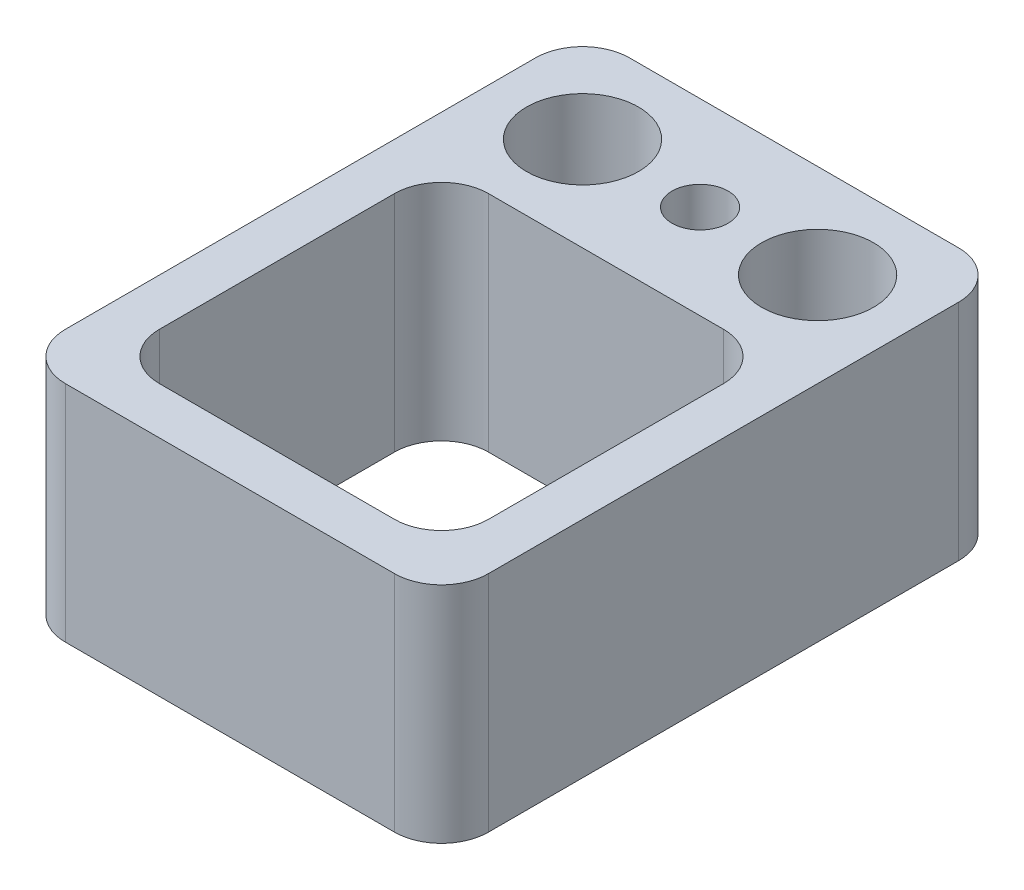
ISO-10303-21;
HEADER;
FILE_DESCRIPTION(('STEP AP214'),'2;1');
FILE_NAME('part.step','',(''),(''),'','','');
FILE_SCHEMA(('AUTOMOTIVE_DESIGN { 1 0 10303 214 1 1 1 1 }'));
ENDSEC;
DATA;
#1=APPLICATION_CONTEXT('core data for automotive mechanical design processes');
#2=APPLICATION_PROTOCOL_DEFINITION('international standard','automotive_design',2000,#1);
#3=PRODUCT_CONTEXT('',#1,'mechanical');
#4=PRODUCT('Part','Part','',(#3));
#5=PRODUCT_RELATED_PRODUCT_CATEGORY('part','',(#4));
#6=PRODUCT_DEFINITION_FORMATION('','',#4);
#7=PRODUCT_DEFINITION_CONTEXT('part definition',#1,'design');
#8=PRODUCT_DEFINITION('design','',#6,#7);
#9=PRODUCT_DEFINITION_SHAPE('','',#8);
#10=(LENGTH_UNIT() NAMED_UNIT(*) SI_UNIT(.MILLI.,.METRE.));
#11=(NAMED_UNIT(*) PLANE_ANGLE_UNIT() SI_UNIT($,.RADIAN.));
#12=(NAMED_UNIT(*) SI_UNIT($,.STERADIAN.) SOLID_ANGLE_UNIT());
#13=UNCERTAINTY_MEASURE_WITH_UNIT(LENGTH_MEASURE(1.E-05),#10,'distance_accuracy_value','');
#14=(GEOMETRIC_REPRESENTATION_CONTEXT(3) GLOBAL_UNCERTAINTY_ASSIGNED_CONTEXT((#13)) GLOBAL_UNIT_ASSIGNED_CONTEXT((#10,
#11,#12)) REPRESENTATION_CONTEXT('',''));
#15=CARTESIAN_POINT('',(0.,0.,0.));
#16=DIRECTION('',(0.,0.,1.));
#17=DIRECTION('',(1.,0.,0.));
#18=AXIS2_PLACEMENT_3D('',#15,#16,#17);
#19=CARTESIAN_POINT('',(-4.5,4.7625,6.));
#20=DIRECTION('',(1.,0.,0.));
#21=DIRECTION('',(0.,0.,-1.));
#22=AXIS2_PLACEMENT_3D('',#19,#20,#21);
#23=PLANE('',#22);
#24=DIRECTION('',(0.,0.,1.));
#25=VECTOR('',#24,1.);
#26=CARTESIAN_POINT('',(-4.5,0.,6.));
#27=LINE('',#26,#25);
#28=CARTESIAN_POINT('',(-4.5,0.,-5.));
#29=VERTEX_POINT('',#28);
#30=CARTESIAN_POINT('',(-4.5,0.,5.));
#31=VERTEX_POINT('',#30);
#32=EDGE_CURVE('E196',#29,#31,#27,.T.);
#33=ORIENTED_EDGE('',*,*,#32,.T.);
#34=DIRECTION('',(0.,-1.,0.));
#35=VECTOR('',#34,1.);
#36=CARTESIAN_POINT('',(-4.5,4.7625,5.));
#37=LINE('',#36,#35);
#38=CARTESIAN_POINT('',(-4.5,4.7625,5.));
#39=VERTEX_POINT('',#38);
#40=EDGE_CURVE('E246',#31,#39,#37,.F.);
#41=ORIENTED_EDGE('',*,*,#40,.T.);
#42=DIRECTION('',(0.,0.,1.));
#43=VECTOR('',#42,1.);
#44=CARTESIAN_POINT('',(-4.5,4.7625,6.));
#45=LINE('',#44,#43);
#46=CARTESIAN_POINT('',(-4.5,4.7625,-5.));
#47=VERTEX_POINT('',#46);
#48=EDGE_CURVE('E185',#47,#39,#45,.T.);
#49=ORIENTED_EDGE('',*,*,#48,.F.);
#50=DIRECTION('',(0.,-1.,0.));
#51=VECTOR('',#50,1.);
#52=CARTESIAN_POINT('',(-4.5,4.7625,-5.));
#53=LINE('',#52,#51);
#54=EDGE_CURVE('E243',#47,#29,#53,.T.);
#55=ORIENTED_EDGE('',*,*,#54,.T.);
#56=EDGE_LOOP('',(#33,#41,#49,#55));
#57=FACE_BOUND('',#56,.T.);
#58=ADVANCED_FACE('F31',(#57),#23,.F.);
#59=CARTESIAN_POINT('',(4.5,4.7625,6.));
#60=DIRECTION('',(0.,0.,-1.));
#61=DIRECTION('',(-1.,0.,0.));
#62=AXIS2_PLACEMENT_3D('',#59,#60,#61);
#63=PLANE('',#62);
#64=DIRECTION('',(1.,0.,0.));
#65=VECTOR('',#64,1.);
#66=CARTESIAN_POINT('',(4.5,4.7625,6.));
#67=LINE('',#66,#65);
#68=CARTESIAN_POINT('',(-3.5,4.7625,6.));
#69=VERTEX_POINT('',#68);
#70=CARTESIAN_POINT('',(3.5,4.7625,6.));
#71=VERTEX_POINT('',#70);
#72=EDGE_CURVE('E188',#69,#71,#67,.T.);
#73=ORIENTED_EDGE('',*,*,#72,.F.);
#74=DIRECTION('',(0.,-1.,0.));
#75=VECTOR('',#74,1.);
#76=CARTESIAN_POINT('',(-3.5,4.7625,6.));
#77=LINE('',#76,#75);
#78=CARTESIAN_POINT('',(-3.5,0.,6.));
#79=VERTEX_POINT('',#78);
#80=EDGE_CURVE('E232',#69,#79,#77,.T.);
#81=ORIENTED_EDGE('',*,*,#80,.T.);
#82=DIRECTION('',(1.,0.,0.));
#83=VECTOR('',#82,1.);
#84=CARTESIAN_POINT('',(4.5,0.,6.));
#85=LINE('',#84,#83);
#86=CARTESIAN_POINT('',(3.5,0.,6.));
#87=VERTEX_POINT('',#86);
#88=EDGE_CURVE('E199',#79,#87,#85,.T.);
#89=ORIENTED_EDGE('',*,*,#88,.T.);
#90=DIRECTION('',(0.,-1.,0.));
#91=VECTOR('',#90,1.);
#92=CARTESIAN_POINT('',(3.5,4.7625,6.));
#93=LINE('',#92,#91);
#94=EDGE_CURVE('E230',#87,#71,#93,.F.);
#95=ORIENTED_EDGE('',*,*,#94,.T.);
#96=EDGE_LOOP('',(#73,#81,#89,#95));
#97=FACE_BOUND('',#96,.T.);
#98=ADVANCED_FACE('F316',(#97),#63,.F.);
#99=CARTESIAN_POINT('',(4.5,4.7625,6.));
#100=DIRECTION('',(-1.,0.,0.));
#101=DIRECTION('',(0.,0.,1.));
#102=AXIS2_PLACEMENT_3D('',#99,#100,#101);
#103=PLANE('',#102);
#104=DIRECTION('',(0.,0.,-1.));
#105=VECTOR('',#104,1.);
#106=CARTESIAN_POINT('',(4.5,4.7625,6.));
#107=LINE('',#106,#105);
#108=CARTESIAN_POINT('',(4.5,4.7625,5.));
#109=VERTEX_POINT('',#108);
#110=CARTESIAN_POINT('',(4.5,4.7625,-5.));
#111=VERTEX_POINT('',#110);
#112=EDGE_CURVE('E192',#109,#111,#107,.T.);
#113=ORIENTED_EDGE('',*,*,#112,.F.);
#114=DIRECTION('',(0.,-1.,0.));
#115=VECTOR('',#114,1.);
#116=CARTESIAN_POINT('',(4.5,4.7625,5.));
#117=LINE('',#116,#115);
#118=CARTESIAN_POINT('',(4.5,0.,5.));
#119=VERTEX_POINT('',#118);
#120=EDGE_CURVE('E257',#109,#119,#117,.T.);
#121=ORIENTED_EDGE('',*,*,#120,.T.);
#122=DIRECTION('',(0.,0.,-1.));
#123=VECTOR('',#122,1.);
#124=CARTESIAN_POINT('',(4.5,0.,6.));
#125=LINE('',#124,#123);
#126=CARTESIAN_POINT('',(4.5,0.,-5.));
#127=VERTEX_POINT('',#126);
#128=EDGE_CURVE('E203',#119,#127,#125,.T.);
#129=ORIENTED_EDGE('',*,*,#128,.T.);
#130=DIRECTION('',(0.,-1.,0.));
#131=VECTOR('',#130,1.);
#132=CARTESIAN_POINT('',(4.5,4.7625,-5.));
#133=LINE('',#132,#131);
#134=EDGE_CURVE('E255',#127,#111,#133,.F.);
#135=ORIENTED_EDGE('',*,*,#134,.T.);
#136=EDGE_LOOP('',(#113,#121,#129,#135));
#137=FACE_BOUND('',#136,.T.);
#138=ADVANCED_FACE('F322',(#137),#103,.F.);
#139=CARTESIAN_POINT('',(4.5,4.7625,-6.));
#140=DIRECTION('',(0.,0.,1.));
#141=DIRECTION('',(1.,0.,0.));
#142=AXIS2_PLACEMENT_3D('',#139,#140,#141);
#143=PLANE('',#142);
#144=DIRECTION('',(-1.,0.,0.));
#145=VECTOR('',#144,1.);
#146=CARTESIAN_POINT('',(4.5,4.7625,-6.));
#147=LINE('',#146,#145);
#148=CARTESIAN_POINT('',(3.5,4.7625,-6.));
#149=VERTEX_POINT('',#148);
#150=CARTESIAN_POINT('',(-3.5,4.7625,-6.));
#151=VERTEX_POINT('',#150);
#152=EDGE_CURVE('E194',#149,#151,#147,.T.);
#153=ORIENTED_EDGE('',*,*,#152,.F.);
#154=DIRECTION('',(0.,-1.,0.));
#155=VECTOR('',#154,1.);
#156=CARTESIAN_POINT('',(3.5,4.7625,-6.));
#157=LINE('',#156,#155);
#158=CARTESIAN_POINT('',(3.5,0.,-6.));
#159=VERTEX_POINT('',#158);
#160=EDGE_CURVE('E156',#149,#159,#157,.T.);
#161=ORIENTED_EDGE('',*,*,#160,.T.);
#162=DIRECTION('',(-1.,0.,0.));
#163=VECTOR('',#162,1.);
#164=CARTESIAN_POINT('',(4.5,0.,-6.));
#165=LINE('',#164,#163);
#166=CARTESIAN_POINT('',(-3.5,0.,-6.));
#167=VERTEX_POINT('',#166);
#168=EDGE_CURVE('E189',#159,#167,#165,.T.);
#169=ORIENTED_EDGE('',*,*,#168,.T.);
#170=DIRECTION('',(0.,-1.,0.));
#171=VECTOR('',#170,1.);
#172=CARTESIAN_POINT('',(-3.5,4.7625,-6.));
#173=LINE('',#172,#171);
#174=EDGE_CURVE('E46',#167,#151,#173,.F.);
#175=ORIENTED_EDGE('',*,*,#174,.T.);
#176=EDGE_LOOP('',(#153,#161,#169,#175));
#177=FACE_BOUND('',#176,.T.);
#178=ADVANCED_FACE('F328',(#177),#143,.F.);
#179=CARTESIAN_POINT('',(-4.5,4.7625,-6.));
#180=DIRECTION('',(0.,1.,0.));
#181=DIRECTION('',(0.,0.,1.));
#182=AXIS2_PLACEMENT_3D('',#179,#180,#181);
#183=PLANE('',#182);
#184=CARTESIAN_POINT('',(-2.5,4.7625,-4.));
#185=DIRECTION('',(0.,1.,0.));
#186=DIRECTION('',(0.,0.,1.));
#187=AXIS2_PLACEMENT_3D('',#184,#185,#186);
#188=CIRCLE('',#187,1.190625);
#189=CARTESIAN_POINT('',(-2.5,4.7625,-2.809375));
#190=VERTEX_POINT('',#189);
#191=EDGE_CURVE('E215',#190,#190,#188,.T.);
#192=ORIENTED_EDGE('',*,*,#191,.F.);
#193=EDGE_LOOP('',(#192));
#194=FACE_BOUND('',#193,.T.);
#195=CARTESIAN_POINT('',(2.5,4.7625,-4.));
#196=DIRECTION('',(0.,1.,0.));
#197=DIRECTION('',(0.,0.,1.));
#198=AXIS2_PLACEMENT_3D('',#195,#196,#197);
#199=CIRCLE('',#198,1.190625);
#200=CARTESIAN_POINT('',(2.5,4.7625,-2.809375));
#201=VERTEX_POINT('',#200);
#202=EDGE_CURVE('E211',#201,#201,#199,.T.);
#203=ORIENTED_EDGE('',*,*,#202,.F.);
#204=EDGE_LOOP('',(#203));
#205=FACE_BOUND('',#204,.T.);
#206=CARTESIAN_POINT('',(0.,4.7625,-4.));
#207=DIRECTION('',(0.,1.,0.));
#208=DIRECTION('',(0.,0.,1.));
#209=AXIS2_PLACEMENT_3D('',#206,#207,#208);
#210=CIRCLE('',#209,0.595629999999988);
#211=CARTESIAN_POINT('',(0.,4.7625,-3.40437000000001));
#212=VERTEX_POINT('',#211);
#213=EDGE_CURVE('E210',#212,#212,#210,.T.);
#214=ORIENTED_EDGE('',*,*,#213,.F.);
#215=EDGE_LOOP('',(#214));
#216=FACE_BOUND('',#215,.T.);
#217=DIRECTION('',(0.,0.,1.));
#218=VECTOR('',#217,1.);
#219=CARTESIAN_POINT('',(-3.5,4.7625,5.));
#220=LINE('',#219,#218);
#221=CARTESIAN_POINT('',(-3.5,4.7625,-1.));
#222=VERTEX_POINT('',#221);
#223=CARTESIAN_POINT('',(-3.5,4.7625,4.));
#224=VERTEX_POINT('',#223);
#225=EDGE_CURVE('E173',#222,#224,#220,.T.);
#226=ORIENTED_EDGE('',*,*,#225,.F.);
#227=CARTESIAN_POINT('',(-2.5,4.7625,-1.));
#228=DIRECTION('',(0.,1.,0.));
#229=DIRECTION('',(0.,0.,1.));
#230=AXIS2_PLACEMENT_3D('',#227,#228,#229);
#231=CIRCLE('',#230,1.);
#232=CARTESIAN_POINT('',(-2.5,4.7625,-2.));
#233=VERTEX_POINT('',#232);
#234=EDGE_CURVE('E39',#222,#233,#231,.F.);
#235=ORIENTED_EDGE('',*,*,#234,.T.);
#236=DIRECTION('',(-1.,0.,0.));
#237=VECTOR('',#236,1.);
#238=CARTESIAN_POINT('',(-3.5,4.7625,-2.));
#239=LINE('',#238,#237);
#240=CARTESIAN_POINT('',(2.5,4.7625,-2.));
#241=VERTEX_POINT('',#240);
#242=EDGE_CURVE('E176',#241,#233,#239,.T.);
#243=ORIENTED_EDGE('',*,*,#242,.F.);
#244=CARTESIAN_POINT('',(2.5,4.7625,-1.));
#245=DIRECTION('',(0.,1.,0.));
#246=DIRECTION('',(0.,0.,1.));
#247=AXIS2_PLACEMENT_3D('',#244,#245,#246);
#248=CIRCLE('',#247,1.);
#249=CARTESIAN_POINT('',(3.5,4.7625,-1.));
#250=VERTEX_POINT('',#249);
#251=EDGE_CURVE('E267',#241,#250,#248,.F.);
#252=ORIENTED_EDGE('',*,*,#251,.T.);
#253=DIRECTION('',(0.,0.,-1.));
#254=VECTOR('',#253,1.);
#255=CARTESIAN_POINT('',(3.5,4.7625,5.));
#256=LINE('',#255,#254);
#257=CARTESIAN_POINT('',(3.5,4.7625,4.));
#258=VERTEX_POINT('',#257);
#259=EDGE_CURVE('E172',#258,#250,#256,.T.);
#260=ORIENTED_EDGE('',*,*,#259,.F.);
#261=CARTESIAN_POINT('',(2.5,4.7625,4.));
#262=DIRECTION('',(0.,1.,0.));
#263=DIRECTION('',(0.,0.,1.));
#264=AXIS2_PLACEMENT_3D('',#261,#262,#263);
#265=CIRCLE('',#264,1.);
#266=CARTESIAN_POINT('',(2.5,4.7625,5.));
#267=VERTEX_POINT('',#266);
#268=EDGE_CURVE('E171',#258,#267,#265,.F.);
#269=ORIENTED_EDGE('',*,*,#268,.T.);
#270=DIRECTION('',(1.,0.,0.));
#271=VECTOR('',#270,1.);
#272=CARTESIAN_POINT('',(-3.5,4.7625,5.));
#273=LINE('',#272,#271);
#274=CARTESIAN_POINT('',(-2.5,4.7625,5.));
#275=VERTEX_POINT('',#274);
#276=EDGE_CURVE('E162',#275,#267,#273,.T.);
#277=ORIENTED_EDGE('',*,*,#276,.F.);
#278=CARTESIAN_POINT('',(-2.5,4.7625,4.));
#279=DIRECTION('',(0.,1.,0.));
#280=DIRECTION('',(0.,0.,1.));
#281=AXIS2_PLACEMENT_3D('',#278,#279,#280);
#282=CIRCLE('',#281,1.);
#283=EDGE_CURVE('E145',#275,#224,#282,.F.);
#284=ORIENTED_EDGE('',*,*,#283,.T.);
#285=EDGE_LOOP('',(#226,#235,#243,#252,#260,#269,#277,#284));
#286=FACE_BOUND('',#285,.T.);
#287=ORIENTED_EDGE('',*,*,#48,.T.);
#288=CARTESIAN_POINT('',(-3.5,4.7625,5.));
#289=DIRECTION('',(0.,1.,0.));
#290=DIRECTION('',(0.,0.,1.));
#291=AXIS2_PLACEMENT_3D('',#288,#289,#290);
#292=CIRCLE('',#291,1.);
#293=EDGE_CURVE('E253',#39,#69,#292,.T.);
#294=ORIENTED_EDGE('',*,*,#293,.T.);
#295=ORIENTED_EDGE('',*,*,#72,.T.);
#296=CARTESIAN_POINT('',(3.5,4.7625,5.));
#297=DIRECTION('',(0.,1.,0.));
#298=DIRECTION('',(0.,0.,1.));
#299=AXIS2_PLACEMENT_3D('',#296,#297,#298);
#300=CIRCLE('',#299,1.);
#301=EDGE_CURVE('E251',#71,#109,#300,.T.);
#302=ORIENTED_EDGE('',*,*,#301,.T.);
#303=ORIENTED_EDGE('',*,*,#112,.T.);
#304=CARTESIAN_POINT('',(3.5,4.7625,-5.));
#305=DIRECTION('',(0.,1.,0.));
#306=DIRECTION('',(0.,0.,1.));
#307=AXIS2_PLACEMENT_3D('',#304,#305,#306);
#308=CIRCLE('',#307,1.);
#309=EDGE_CURVE('E53',#111,#149,#308,.T.);
#310=ORIENTED_EDGE('',*,*,#309,.T.);
#311=ORIENTED_EDGE('',*,*,#152,.T.);
#312=CARTESIAN_POINT('',(-3.5,4.7625,-5.));
#313=DIRECTION('',(0.,1.,0.));
#314=DIRECTION('',(0.,0.,1.));
#315=AXIS2_PLACEMENT_3D('',#312,#313,#314);
#316=CIRCLE('',#315,1.);
#317=EDGE_CURVE('E248',#151,#47,#316,.T.);
#318=ORIENTED_EDGE('',*,*,#317,.T.);
#319=EDGE_LOOP('',(#287,#294,#295,#302,#303,#310,#311,#318));
#320=FACE_BOUND('',#319,.T.);
#321=ADVANCED_FACE('F169',(#194,#205,#216,#286,#320),#183,.T.);
#322=CARTESIAN_POINT('',(-4.5,0.,-6.));
#323=DIRECTION('',(0.,1.,0.));
#324=DIRECTION('',(0.,0.,1.));
#325=AXIS2_PLACEMENT_3D('',#322,#323,#324);
#326=PLANE('',#325);
#327=CARTESIAN_POINT('',(-2.5,0.,-4.));
#328=DIRECTION('',(0.,1.,0.));
#329=DIRECTION('',(0.,0.,1.));
#330=AXIS2_PLACEMENT_3D('',#327,#328,#329);
#331=CIRCLE('',#330,1.190625);
#332=CARTESIAN_POINT('',(-2.5,0.,-2.809375));
#333=VERTEX_POINT('',#332);
#334=EDGE_CURVE('E212',#333,#333,#331,.T.);
#335=ORIENTED_EDGE('',*,*,#334,.T.);
#336=EDGE_LOOP('',(#335));
#337=FACE_BOUND('',#336,.T.);
#338=CARTESIAN_POINT('',(2.5,0.,-4.));
#339=DIRECTION('',(0.,1.,0.));
#340=DIRECTION('',(0.,0.,1.));
#341=AXIS2_PLACEMENT_3D('',#338,#339,#340);
#342=CIRCLE('',#341,1.190625);
#343=CARTESIAN_POINT('',(2.5,0.,-2.809375));
#344=VERTEX_POINT('',#343);
#345=EDGE_CURVE('E207',#344,#344,#342,.T.);
#346=ORIENTED_EDGE('',*,*,#345,.T.);
#347=EDGE_LOOP('',(#346));
#348=FACE_BOUND('',#347,.T.);
#349=CARTESIAN_POINT('',(0.,0.,-4.));
#350=DIRECTION('',(0.,1.,0.));
#351=DIRECTION('',(0.,0.,1.));
#352=AXIS2_PLACEMENT_3D('',#349,#350,#351);
#353=CIRCLE('',#352,0.595629999999999);
#354=CARTESIAN_POINT('',(0.,0.,-3.40437));
#355=VERTEX_POINT('',#354);
#356=EDGE_CURVE('E178',#355,#355,#353,.T.);
#357=ORIENTED_EDGE('',*,*,#356,.T.);
#358=EDGE_LOOP('',(#357));
#359=FACE_BOUND('',#358,.T.);
#360=DIRECTION('',(0.,0.,-1.));
#361=VECTOR('',#360,1.);
#362=CARTESIAN_POINT('',(3.5,0.,5.));
#363=LINE('',#362,#361);
#364=CARTESIAN_POINT('',(3.5,0.,4.));
#365=VERTEX_POINT('',#364);
#366=CARTESIAN_POINT('',(3.5,0.,-1.));
#367=VERTEX_POINT('',#366);
#368=EDGE_CURVE('E290',#365,#367,#363,.T.);
#369=ORIENTED_EDGE('',*,*,#368,.T.);
#370=CARTESIAN_POINT('',(2.5,0.,-1.));
#371=DIRECTION('',(0.,1.,0.));
#372=DIRECTION('',(0.,0.,1.));
#373=AXIS2_PLACEMENT_3D('',#370,#371,#372);
#374=CIRCLE('',#373,1.);
#375=CARTESIAN_POINT('',(2.5,0.,-2.));
#376=VERTEX_POINT('',#375);
#377=EDGE_CURVE('E269',#367,#376,#374,.T.);
#378=ORIENTED_EDGE('',*,*,#377,.T.);
#379=DIRECTION('',(-1.,0.,0.));
#380=VECTOR('',#379,1.);
#381=CARTESIAN_POINT('',(-3.5,0.,-2.));
#382=LINE('',#381,#380);
#383=CARTESIAN_POINT('',(-2.5,0.,-2.));
#384=VERTEX_POINT('',#383);
#385=EDGE_CURVE('E200',#376,#384,#382,.T.);
#386=ORIENTED_EDGE('',*,*,#385,.T.);
#387=CARTESIAN_POINT('',(-2.5,0.,-1.));
#388=DIRECTION('',(0.,1.,0.));
#389=DIRECTION('',(0.,0.,1.));
#390=AXIS2_PLACEMENT_3D('',#387,#388,#389);
#391=CIRCLE('',#390,1.);
#392=CARTESIAN_POINT('',(-3.5,0.,-1.));
#393=VERTEX_POINT('',#392);
#394=EDGE_CURVE('E11',#384,#393,#391,.T.);
#395=ORIENTED_EDGE('',*,*,#394,.T.);
#396=DIRECTION('',(0.,0.,1.));
#397=VECTOR('',#396,1.);
#398=CARTESIAN_POINT('',(-3.5,0.,5.));
#399=LINE('',#398,#397);
#400=CARTESIAN_POINT('',(-3.5,0.,4.));
#401=VERTEX_POINT('',#400);
#402=EDGE_CURVE('E184',#393,#401,#399,.T.);
#403=ORIENTED_EDGE('',*,*,#402,.T.);
#404=CARTESIAN_POINT('',(-2.5,0.,4.));
#405=DIRECTION('',(0.,1.,0.));
#406=DIRECTION('',(0.,0.,1.));
#407=AXIS2_PLACEMENT_3D('',#404,#405,#406);
#408=CIRCLE('',#407,1.);
#409=CARTESIAN_POINT('',(-2.5,0.,5.));
#410=VERTEX_POINT('',#409);
#411=EDGE_CURVE('E155',#401,#410,#408,.T.);
#412=ORIENTED_EDGE('',*,*,#411,.T.);
#413=DIRECTION('',(1.,0.,0.));
#414=VECTOR('',#413,1.);
#415=CARTESIAN_POINT('',(-3.5,0.,5.));
#416=LINE('',#415,#414);
#417=CARTESIAN_POINT('',(2.5,0.,5.));
#418=VERTEX_POINT('',#417);
#419=EDGE_CURVE('E165',#410,#418,#416,.T.);
#420=ORIENTED_EDGE('',*,*,#419,.T.);
#421=CARTESIAN_POINT('',(2.5,0.,4.));
#422=DIRECTION('',(0.,1.,0.));
#423=DIRECTION('',(0.,0.,1.));
#424=AXIS2_PLACEMENT_3D('',#421,#422,#423);
#425=CIRCLE('',#424,1.);
#426=EDGE_CURVE('E265',#418,#365,#425,.T.);
#427=ORIENTED_EDGE('',*,*,#426,.T.);
#428=EDGE_LOOP('',(#369,#378,#386,#395,#403,#412,#420,#427));
#429=FACE_BOUND('',#428,.T.);
#430=ORIENTED_EDGE('',*,*,#88,.F.);
#431=CARTESIAN_POINT('',(-3.5,0.,5.));
#432=DIRECTION('',(0.,1.,0.));
#433=DIRECTION('',(0.,0.,1.));
#434=AXIS2_PLACEMENT_3D('',#431,#432,#433);
#435=CIRCLE('',#434,1.);
#436=EDGE_CURVE('E241',#79,#31,#435,.F.);
#437=ORIENTED_EDGE('',*,*,#436,.T.);
#438=ORIENTED_EDGE('',*,*,#32,.F.);
#439=CARTESIAN_POINT('',(-3.5,0.,-5.));
#440=DIRECTION('',(0.,1.,0.));
#441=DIRECTION('',(0.,0.,1.));
#442=AXIS2_PLACEMENT_3D('',#439,#440,#441);
#443=CIRCLE('',#442,1.);
#444=EDGE_CURVE('E235',#29,#167,#443,.F.);
#445=ORIENTED_EDGE('',*,*,#444,.T.);
#446=ORIENTED_EDGE('',*,*,#168,.F.);
#447=CARTESIAN_POINT('',(3.5,0.,-5.));
#448=DIRECTION('',(0.,1.,0.));
#449=DIRECTION('',(0.,0.,1.));
#450=AXIS2_PLACEMENT_3D('',#447,#448,#449);
#451=CIRCLE('',#450,1.);
#452=EDGE_CURVE('E237',#159,#127,#451,.F.);
#453=ORIENTED_EDGE('',*,*,#452,.T.);
#454=ORIENTED_EDGE('',*,*,#128,.F.);
#455=CARTESIAN_POINT('',(3.5,0.,5.));
#456=DIRECTION('',(0.,1.,0.));
#457=DIRECTION('',(0.,0.,1.));
#458=AXIS2_PLACEMENT_3D('',#455,#456,#457);
#459=CIRCLE('',#458,1.);
#460=EDGE_CURVE('E239',#119,#87,#459,.F.);
#461=ORIENTED_EDGE('',*,*,#460,.T.);
#462=EDGE_LOOP('',(#430,#437,#438,#445,#446,#453,#454,#461));
#463=FACE_BOUND('',#462,.T.);
#464=ADVANCED_FACE('F285',(#337,#348,#359,#429,#463),#326,.F.);
#465=CARTESIAN_POINT('',(-3.5,0.,5.));
#466=DIRECTION('',(-1.,0.,0.));
#467=DIRECTION('',(0.,0.,1.));
#468=AXIS2_PLACEMENT_3D('',#465,#466,#467);
#469=PLANE('',#468);
#470=ORIENTED_EDGE('',*,*,#225,.T.);
#471=DIRECTION('',(0.,1.,0.));
#472=VECTOR('',#471,1.);
#473=CARTESIAN_POINT('',(-3.5,0.,4.));
#474=LINE('',#473,#472);
#475=EDGE_CURVE('E150',#224,#401,#474,.F.);
#476=ORIENTED_EDGE('',*,*,#475,.T.);
#477=ORIENTED_EDGE('',*,*,#402,.F.);
#478=DIRECTION('',(0.,1.,0.));
#479=VECTOR('',#478,1.);
#480=CARTESIAN_POINT('',(-3.5,4.7625,-1.));
#481=LINE('',#480,#479);
#482=EDGE_CURVE('E166',#393,#222,#481,.T.);
#483=ORIENTED_EDGE('',*,*,#482,.T.);
#484=EDGE_LOOP('',(#470,#476,#477,#483));
#485=FACE_BOUND('',#484,.T.);
#486=ADVANCED_FACE('F288',(#485),#469,.F.);
#487=CARTESIAN_POINT('',(-3.5,0.,-2.));
#488=DIRECTION('',(0.,0.,-1.));
#489=DIRECTION('',(-1.,0.,0.));
#490=AXIS2_PLACEMENT_3D('',#487,#488,#489);
#491=PLANE('',#490);
#492=ORIENTED_EDGE('',*,*,#385,.F.);
#493=DIRECTION('',(0.,1.,0.));
#494=VECTOR('',#493,1.);
#495=CARTESIAN_POINT('',(2.5,4.7625,-2.));
#496=LINE('',#495,#494);
#497=EDGE_CURVE('E227',#376,#241,#496,.T.);
#498=ORIENTED_EDGE('',*,*,#497,.T.);
#499=ORIENTED_EDGE('',*,*,#242,.T.);
#500=DIRECTION('',(0.,1.,0.));
#501=VECTOR('',#500,1.);
#502=CARTESIAN_POINT('',(-2.5,0.,-2.));
#503=LINE('',#502,#501);
#504=EDGE_CURVE('E225',#233,#384,#503,.F.);
#505=ORIENTED_EDGE('',*,*,#504,.T.);
#506=EDGE_LOOP('',(#492,#498,#499,#505));
#507=FACE_BOUND('',#506,.T.);
#508=ADVANCED_FACE('F276',(#507),#491,.F.);
#509=CARTESIAN_POINT('',(3.5,0.,5.));
#510=DIRECTION('',(1.,0.,0.));
#511=DIRECTION('',(0.,0.,-1.));
#512=AXIS2_PLACEMENT_3D('',#509,#510,#511);
#513=PLANE('',#512);
#514=ORIENTED_EDGE('',*,*,#368,.F.);
#515=DIRECTION('',(0.,1.,0.));
#516=VECTOR('',#515,1.);
#517=CARTESIAN_POINT('',(3.5,4.7625,4.));
#518=LINE('',#517,#516);
#519=EDGE_CURVE('E222',#365,#258,#518,.T.);
#520=ORIENTED_EDGE('',*,*,#519,.T.);
#521=ORIENTED_EDGE('',*,*,#259,.T.);
#522=DIRECTION('',(0.,1.,0.));
#523=VECTOR('',#522,1.);
#524=CARTESIAN_POINT('',(3.5,0.,-1.));
#525=LINE('',#524,#523);
#526=EDGE_CURVE('E220',#250,#367,#525,.F.);
#527=ORIENTED_EDGE('',*,*,#526,.T.);
#528=EDGE_LOOP('',(#514,#520,#521,#527));
#529=FACE_BOUND('',#528,.T.);
#530=ADVANCED_FACE('F303',(#529),#513,.F.);
#531=CARTESIAN_POINT('',(-3.5,0.,5.));
#532=DIRECTION('',(0.,0.,1.));
#533=DIRECTION('',(1.,0.,0.));
#534=AXIS2_PLACEMENT_3D('',#531,#532,#533);
#535=PLANE('',#534);
#536=ORIENTED_EDGE('',*,*,#419,.F.);
#537=DIRECTION('',(0.,1.,0.));
#538=VECTOR('',#537,1.);
#539=CARTESIAN_POINT('',(-2.5,4.7625,5.));
#540=LINE('',#539,#538);
#541=EDGE_CURVE('E149',#410,#275,#540,.T.);
#542=ORIENTED_EDGE('',*,*,#541,.T.);
#543=ORIENTED_EDGE('',*,*,#276,.T.);
#544=DIRECTION('',(0.,1.,0.));
#545=VECTOR('',#544,1.);
#546=CARTESIAN_POINT('',(2.5,0.,5.));
#547=LINE('',#546,#545);
#548=EDGE_CURVE('E167',#267,#418,#547,.F.);
#549=ORIENTED_EDGE('',*,*,#548,.T.);
#550=EDGE_LOOP('',(#536,#542,#543,#549));
#551=FACE_BOUND('',#550,.T.);
#552=ADVANCED_FACE('F161',(#551),#535,.F.);
#553=CARTESIAN_POINT('',(0.,4.7625,-4.));
#554=DIRECTION('',(0.,1.,0.));
#555=DIRECTION('',(0.,0.,1.));
#556=AXIS2_PLACEMENT_3D('',#553,#554,#555);
#557=CYLINDRICAL_SURFACE('',#556,0.595629999999993);
#558=ORIENTED_EDGE('',*,*,#356,.F.);
#559=EDGE_LOOP('',(#558));
#560=FACE_BOUND('',#559,.T.);
#561=ORIENTED_EDGE('',*,*,#213,.T.);
#562=EDGE_LOOP('',(#561));
#563=FACE_BOUND('',#562,.T.);
#564=ADVANCED_FACE('F342',(#560,#563),#557,.F.);
#565=CARTESIAN_POINT('',(2.5,4.7625,-4.));
#566=DIRECTION('',(0.,1.,0.));
#567=DIRECTION('',(0.,0.,1.));
#568=AXIS2_PLACEMENT_3D('',#565,#566,#567);
#569=CYLINDRICAL_SURFACE('',#568,1.190625);
#570=ORIENTED_EDGE('',*,*,#202,.T.);
#571=EDGE_LOOP('',(#570));
#572=FACE_BOUND('',#571,.T.);
#573=ORIENTED_EDGE('',*,*,#345,.F.);
#574=EDGE_LOOP('',(#573));
#575=FACE_BOUND('',#574,.T.);
#576=ADVANCED_FACE('F349',(#572,#575),#569,.F.);
#577=CARTESIAN_POINT('',(-2.5,4.7625,-4.));
#578=DIRECTION('',(0.,1.,0.));
#579=DIRECTION('',(0.,0.,1.));
#580=AXIS2_PLACEMENT_3D('',#577,#578,#579);
#581=CYLINDRICAL_SURFACE('',#580,1.190625);
#582=ORIENTED_EDGE('',*,*,#191,.T.);
#583=EDGE_LOOP('',(#582));
#584=FACE_BOUND('',#583,.T.);
#585=ORIENTED_EDGE('',*,*,#334,.F.);
#586=EDGE_LOOP('',(#585));
#587=FACE_BOUND('',#586,.T.);
#588=ADVANCED_FACE('F313',(#584,#587),#581,.F.);
#589=CARTESIAN_POINT('',(-2.5,0.,4.));
#590=DIRECTION('',(0.,-1.,0.));
#591=DIRECTION('',(0.,0.,-1.));
#592=AXIS2_PLACEMENT_3D('',#589,#590,#591);
#593=CYLINDRICAL_SURFACE('',#592,1.);
#594=ORIENTED_EDGE('',*,*,#411,.F.);
#595=ORIENTED_EDGE('',*,*,#475,.F.);
#596=ORIENTED_EDGE('',*,*,#283,.F.);
#597=ORIENTED_EDGE('',*,*,#541,.F.);
#598=EDGE_LOOP('',(#594,#595,#596,#597));
#599=FACE_BOUND('',#598,.T.);
#600=ADVANCED_FACE('F148',(#599),#593,.F.);
#601=CARTESIAN_POINT('',(2.5,0.,4.));
#602=DIRECTION('',(0.,-1.,0.));
#603=DIRECTION('',(0.,0.,-1.));
#604=AXIS2_PLACEMENT_3D('',#601,#602,#603);
#605=CYLINDRICAL_SURFACE('',#604,1.);
#606=ORIENTED_EDGE('',*,*,#426,.F.);
#607=ORIENTED_EDGE('',*,*,#548,.F.);
#608=ORIENTED_EDGE('',*,*,#268,.F.);
#609=ORIENTED_EDGE('',*,*,#519,.F.);
#610=EDGE_LOOP('',(#606,#607,#608,#609));
#611=FACE_BOUND('',#610,.T.);
#612=ADVANCED_FACE('F305',(#611),#605,.F.);
#613=CARTESIAN_POINT('',(2.5,0.,-1.));
#614=DIRECTION('',(0.,-1.,0.));
#615=DIRECTION('',(0.,0.,-1.));
#616=AXIS2_PLACEMENT_3D('',#613,#614,#615);
#617=CYLINDRICAL_SURFACE('',#616,1.);
#618=ORIENTED_EDGE('',*,*,#377,.F.);
#619=ORIENTED_EDGE('',*,*,#526,.F.);
#620=ORIENTED_EDGE('',*,*,#251,.F.);
#621=ORIENTED_EDGE('',*,*,#497,.F.);
#622=EDGE_LOOP('',(#618,#619,#620,#621));
#623=FACE_BOUND('',#622,.T.);
#624=ADVANCED_FACE('F302',(#623),#617,.F.);
#625=CARTESIAN_POINT('',(-2.5,0.,-1.));
#626=DIRECTION('',(0.,-1.,0.));
#627=DIRECTION('',(0.,0.,-1.));
#628=AXIS2_PLACEMENT_3D('',#625,#626,#627);
#629=CYLINDRICAL_SURFACE('',#628,1.);
#630=ORIENTED_EDGE('',*,*,#394,.F.);
#631=ORIENTED_EDGE('',*,*,#504,.F.);
#632=ORIENTED_EDGE('',*,*,#234,.F.);
#633=ORIENTED_EDGE('',*,*,#482,.F.);
#634=EDGE_LOOP('',(#630,#631,#632,#633));
#635=FACE_BOUND('',#634,.T.);
#636=ADVANCED_FACE('F280',(#635),#629,.F.);
#637=CARTESIAN_POINT('',(-3.5,4.7625,5.));
#638=DIRECTION('',(0.,-1.,0.));
#639=DIRECTION('',(0.,0.,-1.));
#640=AXIS2_PLACEMENT_3D('',#637,#638,#639);
#641=CYLINDRICAL_SURFACE('',#640,1.);
#642=ORIENTED_EDGE('',*,*,#293,.F.);
#643=ORIENTED_EDGE('',*,*,#40,.F.);
#644=ORIENTED_EDGE('',*,*,#436,.F.);
#645=ORIENTED_EDGE('',*,*,#80,.F.);
#646=EDGE_LOOP('',(#642,#643,#644,#645));
#647=FACE_BOUND('',#646,.T.);
#648=ADVANCED_FACE('F406',(#647),#641,.T.);
#649=CARTESIAN_POINT('',(3.5,4.7625,5.));
#650=DIRECTION('',(0.,-1.,0.));
#651=DIRECTION('',(0.,0.,-1.));
#652=AXIS2_PLACEMENT_3D('',#649,#650,#651);
#653=CYLINDRICAL_SURFACE('',#652,1.);
#654=ORIENTED_EDGE('',*,*,#301,.F.);
#655=ORIENTED_EDGE('',*,*,#94,.F.);
#656=ORIENTED_EDGE('',*,*,#460,.F.);
#657=ORIENTED_EDGE('',*,*,#120,.F.);
#658=EDGE_LOOP('',(#654,#655,#656,#657));
#659=FACE_BOUND('',#658,.T.);
#660=ADVANCED_FACE('F415',(#659),#653,.T.);
#661=CARTESIAN_POINT('',(3.5,4.7625,-5.));
#662=DIRECTION('',(0.,-1.,0.));
#663=DIRECTION('',(0.,0.,-1.));
#664=AXIS2_PLACEMENT_3D('',#661,#662,#663);
#665=CYLINDRICAL_SURFACE('',#664,1.);
#666=ORIENTED_EDGE('',*,*,#309,.F.);
#667=ORIENTED_EDGE('',*,*,#134,.F.);
#668=ORIENTED_EDGE('',*,*,#452,.F.);
#669=ORIENTED_EDGE('',*,*,#160,.F.);
#670=EDGE_LOOP('',(#666,#667,#668,#669));
#671=FACE_BOUND('',#670,.T.);
#672=ADVANCED_FACE('F425',(#671),#665,.T.);
#673=CARTESIAN_POINT('',(-3.5,4.7625,-5.));
#674=DIRECTION('',(0.,-1.,0.));
#675=DIRECTION('',(0.,0.,-1.));
#676=AXIS2_PLACEMENT_3D('',#673,#674,#675);
#677=CYLINDRICAL_SURFACE('',#676,1.);
#678=ORIENTED_EDGE('',*,*,#317,.F.);
#679=ORIENTED_EDGE('',*,*,#174,.F.);
#680=ORIENTED_EDGE('',*,*,#444,.F.);
#681=ORIENTED_EDGE('',*,*,#54,.F.);
#682=EDGE_LOOP('',(#678,#679,#680,#681));
#683=FACE_BOUND('',#682,.T.);
#684=ADVANCED_FACE('F33',(#683),#677,.T.);
#685=CLOSED_SHELL('',(#58,#98,#138,#178,#321,#464,#486,#508,#530,#552,#564,#576,#588,#600,#612,
#624,#636,#648,#660,#672,#684));
#686=MANIFOLD_SOLID_BREP('B2',#685);
#687=ADVANCED_BREP_SHAPE_REPRESENTATION('',(#18,#686),#14);
#688=SHAPE_DEFINITION_REPRESENTATION(#9,#687);
ENDSEC;
END-ISO-10303-21;
